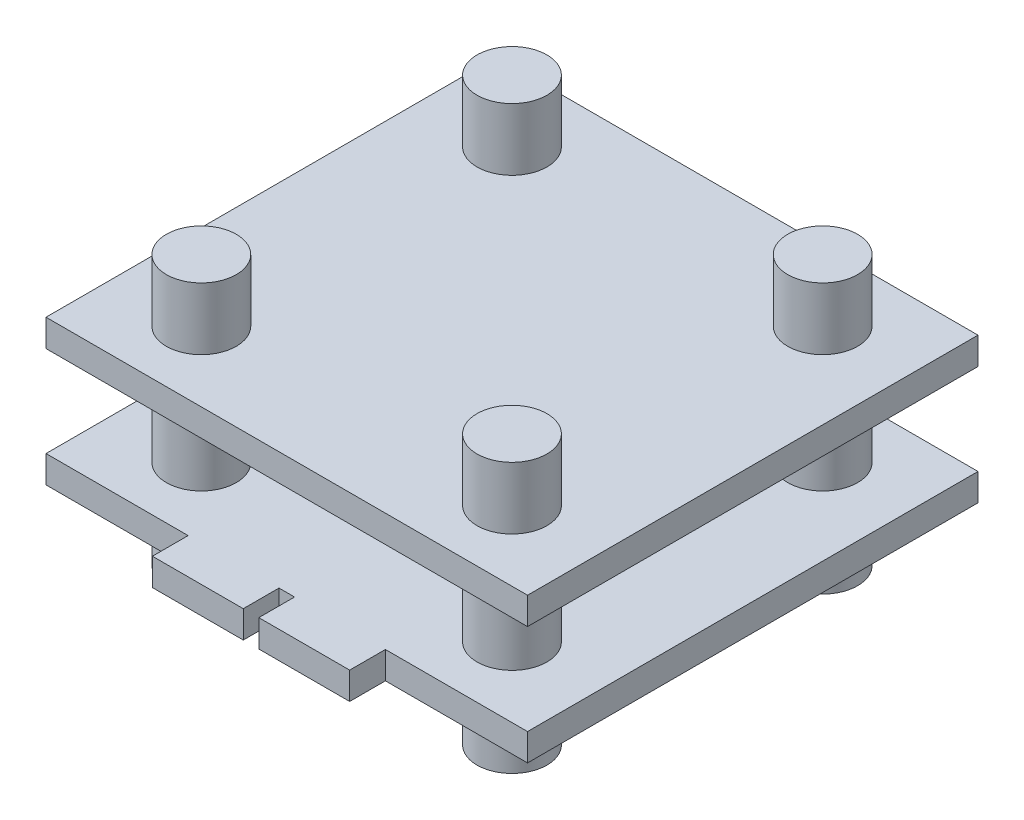
ISO-10303-21;
HEADER;
FILE_DESCRIPTION(('STEP AP214'),'2;1');
FILE_NAME('part.step','',(''),(''),'','','');
FILE_SCHEMA(('AUTOMOTIVE_DESIGN { 1 0 10303 214 1 1 1 1 }'));
ENDSEC;
DATA;
#1=APPLICATION_CONTEXT('core data for automotive mechanical design processes');
#2=APPLICATION_PROTOCOL_DEFINITION('international standard','automotive_design',2000,#1);
#3=PRODUCT_CONTEXT('',#1,'mechanical');
#4=PRODUCT('Part','Part','',(#3));
#5=PRODUCT_RELATED_PRODUCT_CATEGORY('part','',(#4));
#6=PRODUCT_DEFINITION_FORMATION('','',#4);
#7=PRODUCT_DEFINITION_CONTEXT('part definition',#1,'design');
#8=PRODUCT_DEFINITION('design','',#6,#7);
#9=PRODUCT_DEFINITION_SHAPE('','',#8);
#10=(LENGTH_UNIT() NAMED_UNIT(*) SI_UNIT(.MILLI.,.METRE.));
#11=(NAMED_UNIT(*) PLANE_ANGLE_UNIT() SI_UNIT($,.RADIAN.));
#12=(NAMED_UNIT(*) SI_UNIT($,.STERADIAN.) SOLID_ANGLE_UNIT());
#13=UNCERTAINTY_MEASURE_WITH_UNIT(LENGTH_MEASURE(1.E-05),#10,'distance_accuracy_value','');
#14=(GEOMETRIC_REPRESENTATION_CONTEXT(3) GLOBAL_UNCERTAINTY_ASSIGNED_CONTEXT((#13)) GLOBAL_UNIT_ASSIGNED_CONTEXT((#10,
#11,#12)) REPRESENTATION_CONTEXT('',''));
#15=CARTESIAN_POINT('',(0.,0.,0.));
#16=DIRECTION('',(0.,0.,1.));
#17=DIRECTION('',(1.,0.,0.));
#18=AXIS2_PLACEMENT_3D('',#15,#16,#17);
#19=CARTESIAN_POINT('',(-15.5,1.75,14.5));
#20=DIRECTION('',(0.,0.,-1.));
#21=DIRECTION('',(-1.,0.,0.));
#22=AXIS2_PLACEMENT_3D('',#19,#20,#21);
#23=PLANE('',#22);
#24=DIRECTION('',(1.,0.,0.));
#25=VECTOR('',#24,1.);
#26=CARTESIAN_POINT('',(-15.5,1.75,14.5));
#27=LINE('',#26,#25);
#28=CARTESIAN_POINT('',(6.35,1.75,14.5));
#29=VERTEX_POINT('',#28);
#30=CARTESIAN_POINT('',(15.5,1.75,14.5));
#31=VERTEX_POINT('',#30);
#32=EDGE_CURVE('E55',#29,#31,#27,.T.);
#33=ORIENTED_EDGE('',*,*,#32,.F.);
#34=DIRECTION('',(0.,-1.,0.));
#35=VECTOR('',#34,1.);
#36=CARTESIAN_POINT('',(6.35,8.03589691293137,14.5));
#37=LINE('',#36,#35);
#38=CARTESIAN_POINT('',(6.35,0.,14.5));
#39=VERTEX_POINT('',#38);
#40=EDGE_CURVE('E181',#29,#39,#37,.T.);
#41=ORIENTED_EDGE('',*,*,#40,.T.);
#42=DIRECTION('',(1.,0.,0.));
#43=VECTOR('',#42,1.);
#44=CARTESIAN_POINT('',(-15.5,0.,14.5));
#45=LINE('',#44,#43);
#46=CARTESIAN_POINT('',(15.5,0.,14.5));
#47=VERTEX_POINT('',#46);
#48=EDGE_CURVE('E386',#39,#47,#45,.T.);
#49=ORIENTED_EDGE('',*,*,#48,.T.);
#50=DIRECTION('',(0.,-1.,0.));
#51=VECTOR('',#50,1.);
#52=CARTESIAN_POINT('',(15.5,1.75,14.5));
#53=LINE('',#52,#51);
#54=EDGE_CURVE('E375',#31,#47,#53,.T.);
#55=ORIENTED_EDGE('',*,*,#54,.F.);
#56=EDGE_LOOP('',(#33,#41,#49,#55));
#57=FACE_BOUND('',#56,.T.);
#58=ADVANCED_FACE('F39',(#57),#23,.F.);
#59=DIRECTION('',(0.,-1.,0.));
#60=VECTOR('',#59,1.);
#61=CARTESIAN_POINT('',(-6.35,8.03589691293137,14.5));
#62=LINE('',#61,#60);
#63=CARTESIAN_POINT('',(-6.35,1.75,14.5));
#64=VERTEX_POINT('',#63);
#65=CARTESIAN_POINT('',(-6.35,0.,14.5));
#66=VERTEX_POINT('',#65);
#67=EDGE_CURVE('E227',#64,#66,#62,.T.);
#68=ORIENTED_EDGE('',*,*,#67,.F.);
#69=CARTESIAN_POINT('',(-15.5,1.75,14.5));
#70=VERTEX_POINT('',#69);
#71=EDGE_CURVE('E371',#70,#64,#27,.T.);
#72=ORIENTED_EDGE('',*,*,#71,.F.);
#73=DIRECTION('',(0.,-1.,0.));
#74=VECTOR('',#73,1.);
#75=CARTESIAN_POINT('',(-15.5,1.75,14.5));
#76=LINE('',#75,#74);
#77=CARTESIAN_POINT('',(-15.5,0.,14.5));
#78=VERTEX_POINT('',#77);
#79=EDGE_CURVE('E394',#70,#78,#76,.T.);
#80=ORIENTED_EDGE('',*,*,#79,.T.);
#81=EDGE_CURVE('E365',#78,#66,#45,.T.);
#82=ORIENTED_EDGE('',*,*,#81,.T.);
#83=EDGE_LOOP('',(#68,#72,#80,#82));
#84=FACE_BOUND('',#83,.T.);
#85=ADVANCED_FACE('F447',(#84),#23,.F.);
#86=CARTESIAN_POINT('',(15.5,1.75,-14.5));
#87=DIRECTION('',(-1.,0.,0.));
#88=DIRECTION('',(0.,0.,1.));
#89=AXIS2_PLACEMENT_3D('',#86,#87,#88);
#90=PLANE('',#89);
#91=DIRECTION('',(0.,0.,-1.));
#92=VECTOR('',#91,1.);
#93=CARTESIAN_POINT('',(15.5,0.,-14.5));
#94=LINE('',#93,#92);
#95=CARTESIAN_POINT('',(15.5,0.,-14.5));
#96=VERTEX_POINT('',#95);
#97=EDGE_CURVE('E356',#47,#96,#94,.T.);
#98=ORIENTED_EDGE('',*,*,#97,.T.);
#99=DIRECTION('',(0.,-1.,0.));
#100=VECTOR('',#99,1.);
#101=CARTESIAN_POINT('',(15.5,1.75,-14.5));
#102=LINE('',#101,#100);
#103=CARTESIAN_POINT('',(15.5,1.75,-14.5));
#104=VERTEX_POINT('',#103);
#105=EDGE_CURVE('E402',#104,#96,#102,.T.);
#106=ORIENTED_EDGE('',*,*,#105,.F.);
#107=DIRECTION('',(0.,0.,-1.));
#108=VECTOR('',#107,1.);
#109=CARTESIAN_POINT('',(15.5,1.75,-14.5));
#110=LINE('',#109,#108);
#111=EDGE_CURVE('E360',#31,#104,#110,.T.);
#112=ORIENTED_EDGE('',*,*,#111,.F.);
#113=ORIENTED_EDGE('',*,*,#54,.T.);
#114=EDGE_LOOP('',(#98,#106,#112,#113));
#115=FACE_BOUND('',#114,.T.);
#116=ADVANCED_FACE('F41',(#115),#90,.F.);
#117=CARTESIAN_POINT('',(-15.5,1.75,-14.5));
#118=DIRECTION('',(0.,0.,1.));
#119=DIRECTION('',(1.,0.,0.));
#120=AXIS2_PLACEMENT_3D('',#117,#118,#119);
#121=PLANE('',#120);
#122=DIRECTION('',(-1.,0.,0.));
#123=VECTOR('',#122,1.);
#124=CARTESIAN_POINT('',(-15.5,0.,-14.5));
#125=LINE('',#124,#123);
#126=CARTESIAN_POINT('',(-15.5,0.,-14.5));
#127=VERTEX_POINT('',#126);
#128=EDGE_CURVE('E380',#96,#127,#125,.T.);
#129=ORIENTED_EDGE('',*,*,#128,.T.);
#130=DIRECTION('',(0.,-1.,0.));
#131=VECTOR('',#130,1.);
#132=CARTESIAN_POINT('',(-15.5,1.75,-14.5));
#133=LINE('',#132,#131);
#134=CARTESIAN_POINT('',(-15.5,1.75,-14.5));
#135=VERTEX_POINT('',#134);
#136=EDGE_CURVE('E398',#135,#127,#133,.T.);
#137=ORIENTED_EDGE('',*,*,#136,.F.);
#138=DIRECTION('',(-1.,0.,0.));
#139=VECTOR('',#138,1.);
#140=CARTESIAN_POINT('',(-15.5,1.75,-14.5));
#141=LINE('',#140,#139);
#142=EDGE_CURVE('E364',#104,#135,#141,.T.);
#143=ORIENTED_EDGE('',*,*,#142,.F.);
#144=ORIENTED_EDGE('',*,*,#105,.T.);
#145=EDGE_LOOP('',(#129,#137,#143,#144));
#146=FACE_BOUND('',#145,.T.);
#147=ADVANCED_FACE('F463',(#146),#121,.F.);
#148=CARTESIAN_POINT('',(-15.5,1.75,-14.5));
#149=DIRECTION('',(1.,0.,0.));
#150=DIRECTION('',(0.,0.,-1.));
#151=AXIS2_PLACEMENT_3D('',#148,#149,#150);
#152=PLANE('',#151);
#153=DIRECTION('',(0.,0.,1.));
#154=VECTOR('',#153,1.);
#155=CARTESIAN_POINT('',(-15.5,0.,-14.5));
#156=LINE('',#155,#154);
#157=EDGE_CURVE('E383',#127,#78,#156,.T.);
#158=ORIENTED_EDGE('',*,*,#157,.T.);
#159=ORIENTED_EDGE('',*,*,#79,.F.);
#160=DIRECTION('',(0.,0.,1.));
#161=VECTOR('',#160,1.);
#162=CARTESIAN_POINT('',(-15.5,1.75,-14.5));
#163=LINE('',#162,#161);
#164=EDGE_CURVE('E368',#135,#70,#163,.T.);
#165=ORIENTED_EDGE('',*,*,#164,.F.);
#166=ORIENTED_EDGE('',*,*,#136,.T.);
#167=EDGE_LOOP('',(#158,#159,#165,#166));
#168=FACE_BOUND('',#167,.T.);
#169=ADVANCED_FACE('F456',(#168),#152,.F.);
#170=CARTESIAN_POINT('',(-0.500000000000002,0.,14.5));
#171=VERTEX_POINT('',#170);
#172=CARTESIAN_POINT('',(0.5,0.,14.5));
#173=VERTEX_POINT('',#172);
#174=EDGE_CURVE('E390',#171,#173,#45,.T.);
#175=ORIENTED_EDGE('',*,*,#174,.T.);
#176=DIRECTION('',(0.,-1.,0.));
#177=VECTOR('',#176,1.);
#178=CARTESIAN_POINT('',(0.500000000000003,8.03589691293137,14.5));
#179=LINE('',#178,#177);
#180=CARTESIAN_POINT('',(0.5,1.75,14.5));
#181=VERTEX_POINT('',#180);
#182=EDGE_CURVE('E63',#181,#173,#179,.T.);
#183=ORIENTED_EDGE('',*,*,#182,.F.);
#184=CARTESIAN_POINT('',(-0.500000000000002,1.75,14.5));
#185=VERTEX_POINT('',#184);
#186=EDGE_CURVE('E376',#185,#181,#27,.T.);
#187=ORIENTED_EDGE('',*,*,#186,.F.);
#188=DIRECTION('',(0.,-1.,0.));
#189=VECTOR('',#188,1.);
#190=CARTESIAN_POINT('',(-0.500000000000002,8.03589691293137,14.5));
#191=LINE('',#190,#189);
#192=EDGE_CURVE('E223',#185,#171,#191,.T.);
#193=ORIENTED_EDGE('',*,*,#192,.T.);
#194=EDGE_LOOP('',(#175,#183,#187,#193));
#195=FACE_BOUND('',#194,.T.);
#196=ADVANCED_FACE('F449',(#195),#23,.F.);
#197=CARTESIAN_POINT('',(0.,1.75,0.));
#198=DIRECTION('',(0.,1.,0.));
#199=DIRECTION('',(0.,0.,1.));
#200=AXIS2_PLACEMENT_3D('',#197,#198,#199);
#201=PLANE('',#200);
#202=CARTESIAN_POINT('',(-10.,1.75,9.99999999999999));
#203=DIRECTION('',(0.,1.,0.));
#204=DIRECTION('',(0.,0.,-1.));
#205=AXIS2_PLACEMENT_3D('',#202,#203,#204);
#206=CIRCLE('',#205,2.25);
#207=CARTESIAN_POINT('',(-10.,1.75,7.74999999999999));
#208=VERTEX_POINT('',#207);
#209=EDGE_CURVE('E327',#208,#208,#206,.T.);
#210=ORIENTED_EDGE('',*,*,#209,.F.);
#211=EDGE_LOOP('',(#210));
#212=FACE_BOUND('',#211,.T.);
#213=CARTESIAN_POINT('',(9.99999999999999,1.75,10.));
#214=DIRECTION('',(0.,1.,0.));
#215=DIRECTION('',(0.,0.,1.));
#216=AXIS2_PLACEMENT_3D('',#213,#214,#215);
#217=CIRCLE('',#216,2.25);
#218=CARTESIAN_POINT('',(9.99999999999999,1.75,12.25));
#219=VERTEX_POINT('',#218);
#220=EDGE_CURVE('E332',#219,#219,#217,.T.);
#221=ORIENTED_EDGE('',*,*,#220,.F.);
#222=EDGE_LOOP('',(#221));
#223=FACE_BOUND('',#222,.T.);
#224=CARTESIAN_POINT('',(10.,1.75,-10.));
#225=DIRECTION('',(0.,1.,0.));
#226=DIRECTION('',(0.,0.,-1.));
#227=AXIS2_PLACEMENT_3D('',#224,#225,#226);
#228=CIRCLE('',#227,2.25);
#229=CARTESIAN_POINT('',(10.,1.75,-12.25));
#230=VERTEX_POINT('',#229);
#231=EDGE_CURVE('E340',#230,#230,#228,.T.);
#232=ORIENTED_EDGE('',*,*,#231,.F.);
#233=EDGE_LOOP('',(#232));
#234=FACE_BOUND('',#233,.T.);
#235=CARTESIAN_POINT('',(-10.,1.75,-10.));
#236=DIRECTION('',(0.,1.,0.));
#237=DIRECTION('',(0.,0.,1.));
#238=AXIS2_PLACEMENT_3D('',#235,#236,#237);
#239=CIRCLE('',#238,2.25);
#240=CARTESIAN_POINT('',(-10.,1.75,-7.75));
#241=VERTEX_POINT('',#240);
#242=EDGE_CURVE('E348',#241,#241,#239,.T.);
#243=ORIENTED_EDGE('',*,*,#242,.F.);
#244=EDGE_LOOP('',(#243));
#245=FACE_BOUND('',#244,.T.);
#246=ORIENTED_EDGE('',*,*,#111,.T.);
#247=ORIENTED_EDGE('',*,*,#142,.T.);
#248=ORIENTED_EDGE('',*,*,#164,.T.);
#249=ORIENTED_EDGE('',*,*,#71,.T.);
#250=DIRECTION('',(0.,0.,-1.));
#251=VECTOR('',#250,1.);
#252=CARTESIAN_POINT('',(-6.35,1.75,14.5));
#253=LINE('',#252,#251);
#254=CARTESIAN_POINT('',(-6.35,1.75,16.8));
#255=VERTEX_POINT('',#254);
#256=EDGE_CURVE('E224',#255,#64,#253,.T.);
#257=ORIENTED_EDGE('',*,*,#256,.F.);
#258=DIRECTION('',(-1.,0.,0.));
#259=VECTOR('',#258,1.);
#260=CARTESIAN_POINT('',(-0.5,1.75,16.8));
#261=LINE('',#260,#259);
#262=CARTESIAN_POINT('',(-0.5,1.75,16.8));
#263=VERTEX_POINT('',#262);
#264=EDGE_CURVE('E206',#263,#255,#261,.T.);
#265=ORIENTED_EDGE('',*,*,#264,.F.);
#266=DIRECTION('',(0.,0.,1.));
#267=VECTOR('',#266,1.);
#268=CARTESIAN_POINT('',(-0.500000000000002,1.75,14.5));
#269=LINE('',#268,#267);
#270=EDGE_CURVE('E218',#185,#263,#269,.T.);
#271=ORIENTED_EDGE('',*,*,#270,.F.);
#272=ORIENTED_EDGE('',*,*,#186,.T.);
#273=DIRECTION('',(0.,0.,-1.));
#274=VECTOR('',#273,1.);
#275=CARTESIAN_POINT('',(0.500000000000003,1.75,14.5));
#276=LINE('',#275,#274);
#277=CARTESIAN_POINT('',(0.499999999999999,1.75,16.8));
#278=VERTEX_POINT('',#277);
#279=EDGE_CURVE('E166',#278,#181,#276,.T.);
#280=ORIENTED_EDGE('',*,*,#279,.F.);
#281=DIRECTION('',(-1.,0.,0.));
#282=VECTOR('',#281,1.);
#283=CARTESIAN_POINT('',(0.499999999999999,1.75,16.8));
#284=LINE('',#283,#282);
#285=CARTESIAN_POINT('',(6.35,1.75,16.8));
#286=VERTEX_POINT('',#285);
#287=EDGE_CURVE('E162',#286,#278,#284,.T.);
#288=ORIENTED_EDGE('',*,*,#287,.F.);
#289=DIRECTION('',(0.,0.,1.));
#290=VECTOR('',#289,1.);
#291=CARTESIAN_POINT('',(6.35,1.75,14.5));
#292=LINE('',#291,#290);
#293=EDGE_CURVE('E185',#29,#286,#292,.T.);
#294=ORIENTED_EDGE('',*,*,#293,.F.);
#295=ORIENTED_EDGE('',*,*,#32,.T.);
#296=EDGE_LOOP('',(#246,#247,#248,#249,#257,#265,#271,#272,#280,#288,#294,#295));
#297=FACE_BOUND('',#296,.T.);
#298=ADVANCED_FACE('F422',(#212,#223,#234,#245,#297),#201,.T.);
#299=CARTESIAN_POINT('',(0.,0.,0.));
#300=DIRECTION('',(0.,1.,0.));
#301=DIRECTION('',(0.,0.,1.));
#302=AXIS2_PLACEMENT_3D('',#299,#300,#301);
#303=PLANE('',#302);
#304=CARTESIAN_POINT('',(-10.,0.,9.99999999999999));
#305=DIRECTION('',(0.,1.,0.));
#306=DIRECTION('',(0.,0.,1.));
#307=AXIS2_PLACEMENT_3D('',#304,#305,#306);
#308=CIRCLE('',#307,2.25);
#309=CARTESIAN_POINT('',(-10.,0.,12.25));
#310=VERTEX_POINT('',#309);
#311=EDGE_CURVE('E11',#310,#310,#308,.F.);
#312=ORIENTED_EDGE('',*,*,#311,.F.);
#313=EDGE_LOOP('',(#312));
#314=FACE_BOUND('',#313,.T.);
#315=CARTESIAN_POINT('',(-10.,0.,-10.));
#316=DIRECTION('',(0.,1.,0.));
#317=DIRECTION('',(0.,0.,1.));
#318=AXIS2_PLACEMENT_3D('',#315,#316,#317);
#319=CIRCLE('',#318,2.25);
#320=CARTESIAN_POINT('',(-10.,0.,-7.75));
#321=VERTEX_POINT('',#320);
#322=EDGE_CURVE('E48',#321,#321,#319,.F.);
#323=ORIENTED_EDGE('',*,*,#322,.F.);
#324=EDGE_LOOP('',(#323));
#325=FACE_BOUND('',#324,.T.);
#326=CARTESIAN_POINT('',(10.,0.,-10.));
#327=DIRECTION('',(0.,1.,0.));
#328=DIRECTION('',(0.,0.,1.));
#329=AXIS2_PLACEMENT_3D('',#326,#327,#328);
#330=CIRCLE('',#329,2.25);
#331=CARTESIAN_POINT('',(10.,0.,-7.75000000000001));
#332=VERTEX_POINT('',#331);
#333=EDGE_CURVE('E410',#332,#332,#330,.F.);
#334=ORIENTED_EDGE('',*,*,#333,.F.);
#335=EDGE_LOOP('',(#334));
#336=FACE_BOUND('',#335,.T.);
#337=CARTESIAN_POINT('',(9.99999999999999,0.,10.));
#338=DIRECTION('',(0.,1.,0.));
#339=DIRECTION('',(0.,0.,1.));
#340=AXIS2_PLACEMENT_3D('',#337,#338,#339);
#341=CIRCLE('',#340,2.25);
#342=CARTESIAN_POINT('',(9.99999999999999,0.,12.25));
#343=VERTEX_POINT('',#342);
#344=EDGE_CURVE('E406',#343,#343,#341,.F.);
#345=ORIENTED_EDGE('',*,*,#344,.F.);
#346=EDGE_LOOP('',(#345));
#347=FACE_BOUND('',#346,.T.);
#348=ORIENTED_EDGE('',*,*,#97,.F.);
#349=ORIENTED_EDGE('',*,*,#48,.F.);
#350=DIRECTION('',(0.,0.,1.));
#351=VECTOR('',#350,1.);
#352=CARTESIAN_POINT('',(6.35,0.,14.5));
#353=LINE('',#352,#351);
#354=CARTESIAN_POINT('',(6.35,0.,16.8));
#355=VERTEX_POINT('',#354);
#356=EDGE_CURVE('E174',#39,#355,#353,.T.);
#357=ORIENTED_EDGE('',*,*,#356,.T.);
#358=DIRECTION('',(-1.,0.,0.));
#359=VECTOR('',#358,1.);
#360=CARTESIAN_POINT('',(0.499999999999999,0.,16.8));
#361=LINE('',#360,#359);
#362=CARTESIAN_POINT('',(0.499999999999999,0.,16.8));
#363=VERTEX_POINT('',#362);
#364=EDGE_CURVE('E161',#355,#363,#361,.T.);
#365=ORIENTED_EDGE('',*,*,#364,.T.);
#366=DIRECTION('',(0.,0.,-1.));
#367=VECTOR('',#366,1.);
#368=CARTESIAN_POINT('',(0.500000000000003,0.,14.5));
#369=LINE('',#368,#367);
#370=EDGE_CURVE('E169',#363,#173,#369,.T.);
#371=ORIENTED_EDGE('',*,*,#370,.T.);
#372=ORIENTED_EDGE('',*,*,#174,.F.);
#373=DIRECTION('',(0.,0.,1.));
#374=VECTOR('',#373,1.);
#375=CARTESIAN_POINT('',(-0.500000000000002,0.,14.5));
#376=LINE('',#375,#374);
#377=CARTESIAN_POINT('',(-0.5,0.,16.8));
#378=VERTEX_POINT('',#377);
#379=EDGE_CURVE('E201',#171,#378,#376,.T.);
#380=ORIENTED_EDGE('',*,*,#379,.T.);
#381=DIRECTION('',(-1.,0.,0.));
#382=VECTOR('',#381,1.);
#383=CARTESIAN_POINT('',(-0.5,0.,16.8));
#384=LINE('',#383,#382);
#385=CARTESIAN_POINT('',(-6.35,0.,16.8));
#386=VERTEX_POINT('',#385);
#387=EDGE_CURVE('E207',#378,#386,#384,.T.);
#388=ORIENTED_EDGE('',*,*,#387,.T.);
#389=DIRECTION('',(0.,0.,-1.));
#390=VECTOR('',#389,1.);
#391=CARTESIAN_POINT('',(-6.35,0.,14.5));
#392=LINE('',#391,#390);
#393=EDGE_CURVE('E202',#386,#66,#392,.T.);
#394=ORIENTED_EDGE('',*,*,#393,.T.);
#395=ORIENTED_EDGE('',*,*,#81,.F.);
#396=ORIENTED_EDGE('',*,*,#157,.F.);
#397=ORIENTED_EDGE('',*,*,#128,.F.);
#398=EDGE_LOOP('',(#348,#349,#357,#365,#371,#372,#380,#388,#394,#395,#396,#397));
#399=FACE_BOUND('',#398,.T.);
#400=ADVANCED_FACE('F178',(#314,#325,#336,#347,#399),#303,.F.);
#401=CARTESIAN_POINT('',(-10.,7.6,-10.));
#402=DIRECTION('',(0.,-1.,0.));
#403=DIRECTION('',(0.,0.,-1.));
#404=AXIS2_PLACEMENT_3D('',#401,#402,#403);
#405=CYLINDRICAL_SURFACE('',#404,2.25);
#406=CARTESIAN_POINT('',(-10.,7.6,-10.));
#407=DIRECTION('',(0.,1.,0.));
#408=DIRECTION('',(0.,0.,1.));
#409=AXIS2_PLACEMENT_3D('',#406,#407,#408);
#410=CIRCLE('',#409,2.25);
#411=CARTESIAN_POINT('',(-10.,7.6,-7.75));
#412=VERTEX_POINT('',#411);
#413=EDGE_CURVE('E352',#412,#412,#410,.T.);
#414=ORIENTED_EDGE('',*,*,#413,.F.);
#415=EDGE_LOOP('',(#414));
#416=FACE_BOUND('',#415,.T.);
#417=ORIENTED_EDGE('',*,*,#242,.T.);
#418=EDGE_LOOP('',(#417));
#419=FACE_BOUND('',#418,.T.);
#420=ADVANCED_FACE('F421',(#416,#419),#405,.T.);
#421=CARTESIAN_POINT('',(10.,7.6,-10.));
#422=DIRECTION('',(0.,-1.,0.));
#423=DIRECTION('',(0.,0.,-1.));
#424=AXIS2_PLACEMENT_3D('',#421,#422,#423);
#425=CYLINDRICAL_SURFACE('',#424,2.25);
#426=CARTESIAN_POINT('',(10.,7.6,-10.));
#427=DIRECTION('',(0.,1.,0.));
#428=DIRECTION('',(0.,0.,-1.));
#429=AXIS2_PLACEMENT_3D('',#426,#427,#428);
#430=CIRCLE('',#429,2.25);
#431=CARTESIAN_POINT('',(10.,7.6,-12.25));
#432=VERTEX_POINT('',#431);
#433=EDGE_CURVE('E344',#432,#432,#430,.T.);
#434=ORIENTED_EDGE('',*,*,#433,.F.);
#435=EDGE_LOOP('',(#434));
#436=FACE_BOUND('',#435,.T.);
#437=ORIENTED_EDGE('',*,*,#231,.T.);
#438=EDGE_LOOP('',(#437));
#439=FACE_BOUND('',#438,.T.);
#440=ADVANCED_FACE('F639',(#436,#439),#425,.T.);
#441=CARTESIAN_POINT('',(9.99999999999999,7.6,10.));
#442=DIRECTION('',(0.,-1.,0.));
#443=DIRECTION('',(0.,0.,-1.));
#444=AXIS2_PLACEMENT_3D('',#441,#442,#443);
#445=CYLINDRICAL_SURFACE('',#444,2.25);
#446=CARTESIAN_POINT('',(9.99999999999999,7.6,10.));
#447=DIRECTION('',(0.,1.,0.));
#448=DIRECTION('',(0.,0.,1.));
#449=AXIS2_PLACEMENT_3D('',#446,#447,#448);
#450=CIRCLE('',#449,2.25);
#451=CARTESIAN_POINT('',(9.99999999999999,7.6,12.25));
#452=VERTEX_POINT('',#451);
#453=EDGE_CURVE('E336',#452,#452,#450,.T.);
#454=ORIENTED_EDGE('',*,*,#453,.F.);
#455=EDGE_LOOP('',(#454));
#456=FACE_BOUND('',#455,.T.);
#457=ORIENTED_EDGE('',*,*,#220,.T.);
#458=EDGE_LOOP('',(#457));
#459=FACE_BOUND('',#458,.T.);
#460=ADVANCED_FACE('F649',(#456,#459),#445,.T.);
#461=CARTESIAN_POINT('',(-10.,7.6,9.99999999999999));
#462=DIRECTION('',(0.,-1.,0.));
#463=DIRECTION('',(0.,0.,-1.));
#464=AXIS2_PLACEMENT_3D('',#461,#462,#463);
#465=CYLINDRICAL_SURFACE('',#464,2.25);
#466=CARTESIAN_POINT('',(-10.,7.6,9.99999999999999));
#467=DIRECTION('',(0.,1.,0.));
#468=DIRECTION('',(0.,0.,-1.));
#469=AXIS2_PLACEMENT_3D('',#466,#467,#468);
#470=CIRCLE('',#469,2.25);
#471=CARTESIAN_POINT('',(-10.,7.6,7.74999999999999));
#472=VERTEX_POINT('',#471);
#473=EDGE_CURVE('E328',#472,#472,#470,.T.);
#474=ORIENTED_EDGE('',*,*,#473,.F.);
#475=EDGE_LOOP('',(#474));
#476=FACE_BOUND('',#475,.T.);
#477=ORIENTED_EDGE('',*,*,#209,.T.);
#478=EDGE_LOOP('',(#477));
#479=FACE_BOUND('',#478,.T.);
#480=ADVANCED_FACE('F658',(#476,#479),#465,.T.);
#481=CARTESIAN_POINT('',(-15.5,9.35,14.5));
#482=DIRECTION('',(0.,0.,-1.));
#483=DIRECTION('',(-1.,0.,0.));
#484=AXIS2_PLACEMENT_3D('',#481,#482,#483);
#485=PLANE('',#484);
#486=DIRECTION('',(1.,0.,0.));
#487=VECTOR('',#486,1.);
#488=CARTESIAN_POINT('',(-15.5,7.6,14.5));
#489=LINE('',#488,#487);
#490=CARTESIAN_POINT('',(-15.5,7.6,14.5));
#491=VERTEX_POINT('',#490);
#492=CARTESIAN_POINT('',(15.5,7.6,14.5));
#493=VERTEX_POINT('',#492);
#494=EDGE_CURVE('E282',#491,#493,#489,.T.);
#495=ORIENTED_EDGE('',*,*,#494,.T.);
#496=DIRECTION('',(0.,-1.,0.));
#497=VECTOR('',#496,1.);
#498=CARTESIAN_POINT('',(15.5,9.35,14.5));
#499=LINE('',#498,#497);
#500=CARTESIAN_POINT('',(15.5,9.35,14.5));
#501=VERTEX_POINT('',#500);
#502=EDGE_CURVE('E323',#501,#493,#499,.T.);
#503=ORIENTED_EDGE('',*,*,#502,.F.);
#504=DIRECTION('',(1.,0.,0.));
#505=VECTOR('',#504,1.);
#506=CARTESIAN_POINT('',(-15.5,9.35,14.5));
#507=LINE('',#506,#505);
#508=CARTESIAN_POINT('',(-15.5,9.35,14.5));
#509=VERTEX_POINT('',#508);
#510=EDGE_CURVE('E286',#509,#501,#507,.T.);
#511=ORIENTED_EDGE('',*,*,#510,.F.);
#512=DIRECTION('',(0.,-1.,0.));
#513=VECTOR('',#512,1.);
#514=CARTESIAN_POINT('',(-15.5,9.35,14.5));
#515=LINE('',#514,#513);
#516=EDGE_CURVE('E300',#509,#491,#515,.T.);
#517=ORIENTED_EDGE('',*,*,#516,.T.);
#518=EDGE_LOOP('',(#495,#503,#511,#517));
#519=FACE_BOUND('',#518,.T.);
#520=ADVANCED_FACE('F667',(#519),#485,.F.);
#521=CARTESIAN_POINT('',(15.5,9.35,14.5));
#522=DIRECTION('',(-1.,0.,0.));
#523=DIRECTION('',(0.,0.,1.));
#524=AXIS2_PLACEMENT_3D('',#521,#522,#523);
#525=PLANE('',#524);
#526=DIRECTION('',(0.,0.,-1.));
#527=VECTOR('',#526,1.);
#528=CARTESIAN_POINT('',(15.5,7.6,14.5));
#529=LINE('',#528,#527);
#530=CARTESIAN_POINT('',(15.5,7.6,-14.5));
#531=VERTEX_POINT('',#530);
#532=EDGE_CURVE('E304',#493,#531,#529,.T.);
#533=ORIENTED_EDGE('',*,*,#532,.T.);
#534=DIRECTION('',(0.,-1.,0.));
#535=VECTOR('',#534,1.);
#536=CARTESIAN_POINT('',(15.5,9.35,-14.5));
#537=LINE('',#536,#535);
#538=CARTESIAN_POINT('',(15.5,9.35,-14.5));
#539=VERTEX_POINT('',#538);
#540=EDGE_CURVE('E319',#539,#531,#537,.T.);
#541=ORIENTED_EDGE('',*,*,#540,.F.);
#542=DIRECTION('',(0.,0.,-1.));
#543=VECTOR('',#542,1.);
#544=CARTESIAN_POINT('',(15.5,9.35,14.5));
#545=LINE('',#544,#543);
#546=EDGE_CURVE('E290',#501,#539,#545,.T.);
#547=ORIENTED_EDGE('',*,*,#546,.F.);
#548=ORIENTED_EDGE('',*,*,#502,.T.);
#549=EDGE_LOOP('',(#533,#541,#547,#548));
#550=FACE_BOUND('',#549,.T.);
#551=ADVANCED_FACE('F676',(#550),#525,.F.);
#552=CARTESIAN_POINT('',(15.5,9.35,-14.5));
#553=DIRECTION('',(0.,0.,1.));
#554=DIRECTION('',(1.,0.,0.));
#555=AXIS2_PLACEMENT_3D('',#552,#553,#554);
#556=PLANE('',#555);
#557=DIRECTION('',(-1.,0.,0.));
#558=VECTOR('',#557,1.);
#559=CARTESIAN_POINT('',(15.5,7.6,-14.5));
#560=LINE('',#559,#558);
#561=CARTESIAN_POINT('',(-15.5,7.6,-14.5));
#562=VERTEX_POINT('',#561);
#563=EDGE_CURVE('E307',#531,#562,#560,.T.);
#564=ORIENTED_EDGE('',*,*,#563,.T.);
#565=DIRECTION('',(0.,-1.,0.));
#566=VECTOR('',#565,1.);
#567=CARTESIAN_POINT('',(-15.5,9.35,-14.5));
#568=LINE('',#567,#566);
#569=CARTESIAN_POINT('',(-15.5,9.35,-14.5));
#570=VERTEX_POINT('',#569);
#571=EDGE_CURVE('E315',#570,#562,#568,.T.);
#572=ORIENTED_EDGE('',*,*,#571,.F.);
#573=DIRECTION('',(-1.,0.,0.));
#574=VECTOR('',#573,1.);
#575=CARTESIAN_POINT('',(15.5,9.35,-14.5));
#576=LINE('',#575,#574);
#577=EDGE_CURVE('E294',#539,#570,#576,.T.);
#578=ORIENTED_EDGE('',*,*,#577,.F.);
#579=ORIENTED_EDGE('',*,*,#540,.T.);
#580=EDGE_LOOP('',(#564,#572,#578,#579));
#581=FACE_BOUND('',#580,.T.);
#582=ADVANCED_FACE('F685',(#581),#556,.F.);
#583=CARTESIAN_POINT('',(-15.5,9.35,-14.5));
#584=DIRECTION('',(1.,0.,0.));
#585=DIRECTION('',(0.,0.,-1.));
#586=AXIS2_PLACEMENT_3D('',#583,#584,#585);
#587=PLANE('',#586);
#588=DIRECTION('',(0.,0.,1.));
#589=VECTOR('',#588,1.);
#590=CARTESIAN_POINT('',(-15.5,7.6,-14.5));
#591=LINE('',#590,#589);
#592=EDGE_CURVE('E291',#562,#491,#591,.T.);
#593=ORIENTED_EDGE('',*,*,#592,.T.);
#594=ORIENTED_EDGE('',*,*,#516,.F.);
#595=DIRECTION('',(0.,0.,1.));
#596=VECTOR('',#595,1.);
#597=CARTESIAN_POINT('',(-15.5,9.35,-14.5));
#598=LINE('',#597,#596);
#599=EDGE_CURVE('E297',#570,#509,#598,.T.);
#600=ORIENTED_EDGE('',*,*,#599,.F.);
#601=ORIENTED_EDGE('',*,*,#571,.T.);
#602=EDGE_LOOP('',(#593,#594,#600,#601));
#603=FACE_BOUND('',#602,.T.);
#604=ADVANCED_FACE('F694',(#603),#587,.F.);
#605=CARTESIAN_POINT('',(0.,9.35,0.));
#606=DIRECTION('',(0.,1.,0.));
#607=DIRECTION('',(0.,0.,1.));
#608=AXIS2_PLACEMENT_3D('',#605,#606,#607);
#609=PLANE('',#608);
#610=CARTESIAN_POINT('',(-10.,9.35,9.99999999999999));
#611=DIRECTION('',(0.,1.,0.));
#612=DIRECTION('',(0.,0.,1.));
#613=AXIS2_PLACEMENT_3D('',#610,#611,#612);
#614=CIRCLE('',#613,2.25);
#615=CARTESIAN_POINT('',(-10.,9.35,12.25));
#616=VERTEX_POINT('',#615);
#617=EDGE_CURVE('E253',#616,#616,#614,.T.);
#618=ORIENTED_EDGE('',*,*,#617,.F.);
#619=EDGE_LOOP('',(#618));
#620=FACE_BOUND('',#619,.T.);
#621=CARTESIAN_POINT('',(9.99999999999999,9.35,10.));
#622=DIRECTION('',(0.,1.,0.));
#623=DIRECTION('',(0.,0.,1.));
#624=AXIS2_PLACEMENT_3D('',#621,#622,#623);
#625=CIRCLE('',#624,2.25);
#626=CARTESIAN_POINT('',(9.99999999999999,9.35,12.25));
#627=VERTEX_POINT('',#626);
#628=EDGE_CURVE('E258',#627,#627,#625,.T.);
#629=ORIENTED_EDGE('',*,*,#628,.F.);
#630=EDGE_LOOP('',(#629));
#631=FACE_BOUND('',#630,.T.);
#632=CARTESIAN_POINT('',(10.,9.35,-10.));
#633=DIRECTION('',(0.,1.,0.));
#634=DIRECTION('',(0.,0.,1.));
#635=AXIS2_PLACEMENT_3D('',#632,#633,#634);
#636=CIRCLE('',#635,2.25);
#637=CARTESIAN_POINT('',(10.,9.35,-7.75000000000001));
#638=VERTEX_POINT('',#637);
#639=EDGE_CURVE('E266',#638,#638,#636,.T.);
#640=ORIENTED_EDGE('',*,*,#639,.F.);
#641=EDGE_LOOP('',(#640));
#642=FACE_BOUND('',#641,.T.);
#643=CARTESIAN_POINT('',(-10.,9.35,-10.));
#644=DIRECTION('',(0.,1.,0.));
#645=DIRECTION('',(0.,0.,1.));
#646=AXIS2_PLACEMENT_3D('',#643,#644,#645);
#647=CIRCLE('',#646,2.25);
#648=CARTESIAN_POINT('',(-10.,9.35,-7.75));
#649=VERTEX_POINT('',#648);
#650=EDGE_CURVE('E274',#649,#649,#647,.T.);
#651=ORIENTED_EDGE('',*,*,#650,.F.);
#652=EDGE_LOOP('',(#651));
#653=FACE_BOUND('',#652,.T.);
#654=ORIENTED_EDGE('',*,*,#510,.T.);
#655=ORIENTED_EDGE('',*,*,#546,.T.);
#656=ORIENTED_EDGE('',*,*,#577,.T.);
#657=ORIENTED_EDGE('',*,*,#599,.T.);
#658=EDGE_LOOP('',(#654,#655,#656,#657));
#659=FACE_BOUND('',#658,.T.);
#660=ADVANCED_FACE('F703',(#620,#631,#642,#653,#659),#609,.T.);
#661=CARTESIAN_POINT('',(0.,7.6,0.));
#662=DIRECTION('',(0.,1.,0.));
#663=DIRECTION('',(0.,0.,1.));
#664=AXIS2_PLACEMENT_3D('',#661,#662,#663);
#665=PLANE('',#664);
#666=ORIENTED_EDGE('',*,*,#413,.T.);
#667=EDGE_LOOP('',(#666));
#668=FACE_BOUND('',#667,.T.);
#669=ORIENTED_EDGE('',*,*,#433,.T.);
#670=EDGE_LOOP('',(#669));
#671=FACE_BOUND('',#670,.T.);
#672=ORIENTED_EDGE('',*,*,#453,.T.);
#673=EDGE_LOOP('',(#672));
#674=FACE_BOUND('',#673,.T.);
#675=ORIENTED_EDGE('',*,*,#473,.T.);
#676=EDGE_LOOP('',(#675));
#677=FACE_BOUND('',#676,.T.);
#678=ORIENTED_EDGE('',*,*,#494,.F.);
#679=ORIENTED_EDGE('',*,*,#592,.F.);
#680=ORIENTED_EDGE('',*,*,#563,.F.);
#681=ORIENTED_EDGE('',*,*,#532,.F.);
#682=EDGE_LOOP('',(#678,#679,#680,#681));
#683=FACE_BOUND('',#682,.T.);
#684=ADVANCED_FACE('F713',(#668,#671,#674,#677,#683),#665,.F.);
#685=CARTESIAN_POINT('',(-10.,13.35,-10.));
#686=DIRECTION('',(0.,-1.,0.));
#687=DIRECTION('',(0.,0.,-1.));
#688=AXIS2_PLACEMENT_3D('',#685,#686,#687);
#689=CYLINDRICAL_SURFACE('',#688,2.25);
#690=CARTESIAN_POINT('',(-10.,13.35,-10.));
#691=DIRECTION('',(0.,1.,0.));
#692=DIRECTION('',(0.,0.,1.));
#693=AXIS2_PLACEMENT_3D('',#690,#691,#692);
#694=CIRCLE('',#693,2.25);
#695=CARTESIAN_POINT('',(-10.,13.35,-7.75));
#696=VERTEX_POINT('',#695);
#697=EDGE_CURVE('E278',#696,#696,#694,.T.);
#698=ORIENTED_EDGE('',*,*,#697,.F.);
#699=EDGE_LOOP('',(#698));
#700=FACE_BOUND('',#699,.T.);
#701=ORIENTED_EDGE('',*,*,#650,.T.);
#702=EDGE_LOOP('',(#701));
#703=FACE_BOUND('',#702,.T.);
#704=ADVANCED_FACE('F722',(#700,#703),#689,.T.);
#705=CARTESIAN_POINT('',(-10.,13.35,-10.));
#706=DIRECTION('',(0.,1.,0.));
#707=DIRECTION('',(0.,0.,1.));
#708=AXIS2_PLACEMENT_3D('',#705,#706,#707);
#709=PLANE('',#708);
#710=ORIENTED_EDGE('',*,*,#697,.T.);
#711=EDGE_LOOP('',(#710));
#712=FACE_BOUND('',#711,.T.);
#713=ADVANCED_FACE('F730',(#712),#709,.T.);
#714=CARTESIAN_POINT('',(10.,13.35,-10.));
#715=DIRECTION('',(0.,-1.,0.));
#716=DIRECTION('',(0.,0.,-1.));
#717=AXIS2_PLACEMENT_3D('',#714,#715,#716);
#718=CYLINDRICAL_SURFACE('',#717,2.25);
#719=CARTESIAN_POINT('',(10.,13.35,-10.));
#720=DIRECTION('',(0.,1.,0.));
#721=DIRECTION('',(0.,0.,1.));
#722=AXIS2_PLACEMENT_3D('',#719,#720,#721);
#723=CIRCLE('',#722,2.25);
#724=CARTESIAN_POINT('',(10.,13.35,-7.75000000000001));
#725=VERTEX_POINT('',#724);
#726=EDGE_CURVE('E270',#725,#725,#723,.T.);
#727=ORIENTED_EDGE('',*,*,#726,.F.);
#728=EDGE_LOOP('',(#727));
#729=FACE_BOUND('',#728,.T.);
#730=ORIENTED_EDGE('',*,*,#639,.T.);
#731=EDGE_LOOP('',(#730));
#732=FACE_BOUND('',#731,.T.);
#733=ADVANCED_FACE('F739',(#729,#732),#718,.T.);
#734=CARTESIAN_POINT('',(10.,13.35,-10.));
#735=DIRECTION('',(0.,1.,0.));
#736=DIRECTION('',(0.,0.,1.));
#737=AXIS2_PLACEMENT_3D('',#734,#735,#736);
#738=PLANE('',#737);
#739=ORIENTED_EDGE('',*,*,#726,.T.);
#740=EDGE_LOOP('',(#739));
#741=FACE_BOUND('',#740,.T.);
#742=ADVANCED_FACE('F748',(#741),#738,.T.);
#743=CARTESIAN_POINT('',(9.99999999999999,13.35,10.));
#744=DIRECTION('',(0.,-1.,0.));
#745=DIRECTION('',(0.,0.,-1.));
#746=AXIS2_PLACEMENT_3D('',#743,#744,#745);
#747=CYLINDRICAL_SURFACE('',#746,2.25);
#748=CARTESIAN_POINT('',(9.99999999999999,13.35,10.));
#749=DIRECTION('',(0.,1.,0.));
#750=DIRECTION('',(0.,0.,1.));
#751=AXIS2_PLACEMENT_3D('',#748,#749,#750);
#752=CIRCLE('',#751,2.25);
#753=CARTESIAN_POINT('',(9.99999999999999,13.35,12.25));
#754=VERTEX_POINT('',#753);
#755=EDGE_CURVE('E262',#754,#754,#752,.T.);
#756=ORIENTED_EDGE('',*,*,#755,.F.);
#757=EDGE_LOOP('',(#756));
#758=FACE_BOUND('',#757,.T.);
#759=ORIENTED_EDGE('',*,*,#628,.T.);
#760=EDGE_LOOP('',(#759));
#761=FACE_BOUND('',#760,.T.);
#762=ADVANCED_FACE('F757',(#758,#761),#747,.T.);
#763=CARTESIAN_POINT('',(9.99999999999999,13.35,10.));
#764=DIRECTION('',(0.,1.,0.));
#765=DIRECTION('',(0.,0.,1.));
#766=AXIS2_PLACEMENT_3D('',#763,#764,#765);
#767=PLANE('',#766);
#768=ORIENTED_EDGE('',*,*,#755,.T.);
#769=EDGE_LOOP('',(#768));
#770=FACE_BOUND('',#769,.T.);
#771=ADVANCED_FACE('F766',(#770),#767,.T.);
#772=CARTESIAN_POINT('',(-10.,13.35,9.99999999999999));
#773=DIRECTION('',(0.,-1.,0.));
#774=DIRECTION('',(0.,0.,-1.));
#775=AXIS2_PLACEMENT_3D('',#772,#773,#774);
#776=CYLINDRICAL_SURFACE('',#775,2.25);
#777=CARTESIAN_POINT('',(-10.,13.35,9.99999999999999));
#778=DIRECTION('',(0.,1.,0.));
#779=DIRECTION('',(0.,0.,1.));
#780=AXIS2_PLACEMENT_3D('',#777,#778,#779);
#781=CIRCLE('',#780,2.25);
#782=CARTESIAN_POINT('',(-10.,13.35,12.25));
#783=VERTEX_POINT('',#782);
#784=EDGE_CURVE('E254',#783,#783,#781,.T.);
#785=ORIENTED_EDGE('',*,*,#784,.F.);
#786=EDGE_LOOP('',(#785));
#787=FACE_BOUND('',#786,.T.);
#788=ORIENTED_EDGE('',*,*,#617,.T.);
#789=EDGE_LOOP('',(#788));
#790=FACE_BOUND('',#789,.T.);
#791=ADVANCED_FACE('F442',(#787,#790),#776,.T.);
#792=CARTESIAN_POINT('',(-10.,13.35,9.99999999999999));
#793=DIRECTION('',(0.,1.,0.));
#794=DIRECTION('',(0.,0.,1.));
#795=AXIS2_PLACEMENT_3D('',#792,#793,#794);
#796=PLANE('',#795);
#797=ORIENTED_EDGE('',*,*,#784,.T.);
#798=EDGE_LOOP('',(#797));
#799=FACE_BOUND('',#798,.T.);
#800=ADVANCED_FACE('F432',(#799),#796,.T.);
#801=CARTESIAN_POINT('',(9.99999999999999,-4.,10.));
#802=DIRECTION('',(0.,1.,0.));
#803=DIRECTION('',(0.,0.,1.));
#804=AXIS2_PLACEMENT_3D('',#801,#802,#803);
#805=CYLINDRICAL_SURFACE('',#804,2.25);
#806=CARTESIAN_POINT('',(9.99999999999999,-4.,10.));
#807=DIRECTION('',(0.,-1.,0.));
#808=DIRECTION('',(0.,0.,-1.));
#809=AXIS2_PLACEMENT_3D('',#806,#807,#808);
#810=CIRCLE('',#809,2.25);
#811=CARTESIAN_POINT('',(9.99999999999999,-4.,7.75000000000001));
#812=VERTEX_POINT('',#811);
#813=EDGE_CURVE('E249',#812,#812,#810,.T.);
#814=ORIENTED_EDGE('',*,*,#813,.F.);
#815=EDGE_LOOP('',(#814));
#816=FACE_BOUND('',#815,.T.);
#817=ORIENTED_EDGE('',*,*,#344,.T.);
#818=EDGE_LOOP('',(#817));
#819=FACE_BOUND('',#818,.T.);
#820=ADVANCED_FACE('F429',(#816,#819),#805,.T.);
#821=CARTESIAN_POINT('',(9.99999999999999,-4.,10.));
#822=DIRECTION('',(0.,-1.,0.));
#823=DIRECTION('',(0.,0.,-1.));
#824=AXIS2_PLACEMENT_3D('',#821,#822,#823);
#825=PLANE('',#824);
#826=ORIENTED_EDGE('',*,*,#813,.T.);
#827=EDGE_LOOP('',(#826));
#828=FACE_BOUND('',#827,.T.);
#829=ADVANCED_FACE('F431',(#828),#825,.T.);
#830=CARTESIAN_POINT('',(10.,-4.,-10.));
#831=DIRECTION('',(0.,1.,0.));
#832=DIRECTION('',(0.,0.,1.));
#833=AXIS2_PLACEMENT_3D('',#830,#831,#832);
#834=CYLINDRICAL_SURFACE('',#833,2.25);
#835=CARTESIAN_POINT('',(10.,-4.,-10.));
#836=DIRECTION('',(0.,-1.,0.));
#837=DIRECTION('',(0.,0.,-1.));
#838=AXIS2_PLACEMENT_3D('',#835,#836,#837);
#839=CIRCLE('',#838,2.25);
#840=CARTESIAN_POINT('',(10.,-4.,-12.25));
#841=VERTEX_POINT('',#840);
#842=EDGE_CURVE('E245',#841,#841,#839,.T.);
#843=ORIENTED_EDGE('',*,*,#842,.F.);
#844=EDGE_LOOP('',(#843));
#845=FACE_BOUND('',#844,.T.);
#846=ORIENTED_EDGE('',*,*,#333,.T.);
#847=EDGE_LOOP('',(#846));
#848=FACE_BOUND('',#847,.T.);
#849=ADVANCED_FACE('F439',(#845,#848),#834,.T.);
#850=CARTESIAN_POINT('',(10.,-4.,-10.));
#851=DIRECTION('',(0.,-1.,0.));
#852=DIRECTION('',(0.,0.,-1.));
#853=AXIS2_PLACEMENT_3D('',#850,#851,#852);
#854=PLANE('',#853);
#855=ORIENTED_EDGE('',*,*,#842,.T.);
#856=EDGE_LOOP('',(#855));
#857=FACE_BOUND('',#856,.T.);
#858=ADVANCED_FACE('F518',(#857),#854,.T.);
#859=CARTESIAN_POINT('',(-10.,-4.,-10.));
#860=DIRECTION('',(0.,1.,0.));
#861=DIRECTION('',(0.,0.,1.));
#862=AXIS2_PLACEMENT_3D('',#859,#860,#861);
#863=CYLINDRICAL_SURFACE('',#862,2.25);
#864=CARTESIAN_POINT('',(-10.,-4.,-10.));
#865=DIRECTION('',(0.,-1.,0.));
#866=DIRECTION('',(0.,0.,-1.));
#867=AXIS2_PLACEMENT_3D('',#864,#865,#866);
#868=CIRCLE('',#867,2.25);
#869=CARTESIAN_POINT('',(-10.,-4.,-12.25));
#870=VERTEX_POINT('',#869);
#871=EDGE_CURVE('E241',#870,#870,#868,.T.);
#872=ORIENTED_EDGE('',*,*,#871,.F.);
#873=EDGE_LOOP('',(#872));
#874=FACE_BOUND('',#873,.T.);
#875=ORIENTED_EDGE('',*,*,#322,.T.);
#876=EDGE_LOOP('',(#875));
#877=FACE_BOUND('',#876,.T.);
#878=ADVANCED_FACE('F417',(#874,#877),#863,.T.);
#879=CARTESIAN_POINT('',(-10.,-4.,-10.));
#880=DIRECTION('',(0.,-1.,0.));
#881=DIRECTION('',(0.,0.,-1.));
#882=AXIS2_PLACEMENT_3D('',#879,#880,#881);
#883=PLANE('',#882);
#884=ORIENTED_EDGE('',*,*,#871,.T.);
#885=EDGE_LOOP('',(#884));
#886=FACE_BOUND('',#885,.T.);
#887=ADVANCED_FACE('F511',(#886),#883,.T.);
#888=CARTESIAN_POINT('',(-10.,-4.,9.99999999999999));
#889=DIRECTION('',(0.,1.,0.));
#890=DIRECTION('',(0.,0.,1.));
#891=AXIS2_PLACEMENT_3D('',#888,#889,#890);
#892=CYLINDRICAL_SURFACE('',#891,2.25);
#893=CARTESIAN_POINT('',(-10.,-4.,9.99999999999999));
#894=DIRECTION('',(0.,-1.,0.));
#895=DIRECTION('',(0.,0.,-1.));
#896=AXIS2_PLACEMENT_3D('',#893,#894,#895);
#897=CIRCLE('',#896,2.25);
#898=CARTESIAN_POINT('',(-10.,-4.,7.74999999999999));
#899=VERTEX_POINT('',#898);
#900=EDGE_CURVE('E237',#899,#899,#897,.T.);
#901=ORIENTED_EDGE('',*,*,#900,.F.);
#902=EDGE_LOOP('',(#901));
#903=FACE_BOUND('',#902,.T.);
#904=ORIENTED_EDGE('',*,*,#311,.T.);
#905=EDGE_LOOP('',(#904));
#906=FACE_BOUND('',#905,.T.);
#907=ADVANCED_FACE('F507',(#903,#906),#892,.T.);
#908=CARTESIAN_POINT('',(-10.,-4.,9.99999999999999));
#909=DIRECTION('',(0.,-1.,0.));
#910=DIRECTION('',(0.,0.,-1.));
#911=AXIS2_PLACEMENT_3D('',#908,#909,#910);
#912=PLANE('',#911);
#913=ORIENTED_EDGE('',*,*,#900,.T.);
#914=EDGE_LOOP('',(#913));
#915=FACE_BOUND('',#914,.T.);
#916=ADVANCED_FACE('F501',(#915),#912,.T.);
#917=CARTESIAN_POINT('',(-0.5,8.03589691293137,16.8));
#918=DIRECTION('',(0.,0.,1.));
#919=DIRECTION('',(1.,0.,0.));
#920=AXIS2_PLACEMENT_3D('',#917,#918,#919);
#921=PLANE('',#920);
#922=DIRECTION('',(0.,-1.,0.));
#923=VECTOR('',#922,1.);
#924=CARTESIAN_POINT('',(-0.5,8.03589691293137,16.8));
#925=LINE('',#924,#923);
#926=EDGE_CURVE('E222',#263,#378,#925,.T.);
#927=ORIENTED_EDGE('',*,*,#926,.F.);
#928=ORIENTED_EDGE('',*,*,#264,.T.);
#929=DIRECTION('',(0.,-1.,0.));
#930=VECTOR('',#929,1.);
#931=CARTESIAN_POINT('',(-6.35,8.03589691293137,16.8));
#932=LINE('',#931,#930);
#933=EDGE_CURVE('E217',#255,#386,#932,.T.);
#934=ORIENTED_EDGE('',*,*,#933,.T.);
#935=ORIENTED_EDGE('',*,*,#387,.F.);
#936=EDGE_LOOP('',(#927,#928,#934,#935));
#937=FACE_BOUND('',#936,.T.);
#938=ADVANCED_FACE('F486',(#937),#921,.T.);
#939=CARTESIAN_POINT('',(-6.35,8.03589691293137,14.5));
#940=DIRECTION('',(-1.,0.,0.));
#941=DIRECTION('',(0.,0.,1.));
#942=AXIS2_PLACEMENT_3D('',#939,#940,#941);
#943=PLANE('',#942);
#944=ORIENTED_EDGE('',*,*,#933,.F.);
#945=ORIENTED_EDGE('',*,*,#256,.T.);
#946=ORIENTED_EDGE('',*,*,#67,.T.);
#947=ORIENTED_EDGE('',*,*,#393,.F.);
#948=EDGE_LOOP('',(#944,#945,#946,#947));
#949=FACE_BOUND('',#948,.T.);
#950=ADVANCED_FACE('F489',(#949),#943,.T.);
#951=CARTESIAN_POINT('',(-0.500000000000002,8.03589691293137,14.5));
#952=DIRECTION('',(1.,0.,0.));
#953=DIRECTION('',(0.,0.,-1.));
#954=AXIS2_PLACEMENT_3D('',#951,#952,#953);
#955=PLANE('',#954);
#956=ORIENTED_EDGE('',*,*,#192,.F.);
#957=ORIENTED_EDGE('',*,*,#270,.T.);
#958=ORIENTED_EDGE('',*,*,#926,.T.);
#959=ORIENTED_EDGE('',*,*,#379,.F.);
#960=EDGE_LOOP('',(#956,#957,#958,#959));
#961=FACE_BOUND('',#960,.T.);
#962=ADVANCED_FACE('F482',(#961),#955,.T.);
#963=CARTESIAN_POINT('',(6.35,8.03589691293137,14.5));
#964=DIRECTION('',(1.,0.,0.));
#965=DIRECTION('',(0.,0.,-1.));
#966=AXIS2_PLACEMENT_3D('',#963,#964,#965);
#967=PLANE('',#966);
#968=ORIENTED_EDGE('',*,*,#40,.F.);
#969=ORIENTED_EDGE('',*,*,#293,.T.);
#970=DIRECTION('',(0.,-1.,0.));
#971=VECTOR('',#970,1.);
#972=CARTESIAN_POINT('',(6.35,8.03589691293137,16.8));
#973=LINE('',#972,#971);
#974=EDGE_CURVE('E193',#286,#355,#973,.T.);
#975=ORIENTED_EDGE('',*,*,#974,.T.);
#976=ORIENTED_EDGE('',*,*,#356,.F.);
#977=EDGE_LOOP('',(#968,#969,#975,#976));
#978=FACE_BOUND('',#977,.T.);
#979=ADVANCED_FACE('F499',(#978),#967,.T.);
#980=CARTESIAN_POINT('',(0.499999999999999,8.03589691293137,16.8));
#981=DIRECTION('',(0.,0.,1.));
#982=DIRECTION('',(1.,0.,0.));
#983=AXIS2_PLACEMENT_3D('',#980,#981,#982);
#984=PLANE('',#983);
#985=ORIENTED_EDGE('',*,*,#974,.F.);
#986=ORIENTED_EDGE('',*,*,#287,.T.);
#987=DIRECTION('',(0.,-1.,0.));
#988=VECTOR('',#987,1.);
#989=CARTESIAN_POINT('',(0.499999999999999,8.03589691293137,16.8));
#990=LINE('',#989,#988);
#991=EDGE_CURVE('E156',#278,#363,#990,.T.);
#992=ORIENTED_EDGE('',*,*,#991,.T.);
#993=ORIENTED_EDGE('',*,*,#364,.F.);
#994=EDGE_LOOP('',(#985,#986,#992,#993));
#995=FACE_BOUND('',#994,.T.);
#996=ADVANCED_FACE('F159',(#995),#984,.T.);
#997=CARTESIAN_POINT('',(0.500000000000003,8.03589691293137,14.5));
#998=DIRECTION('',(-1.,0.,0.));
#999=DIRECTION('',(0.,0.,1.));
#1000=AXIS2_PLACEMENT_3D('',#997,#998,#999);
#1001=PLANE('',#1000);
#1002=ORIENTED_EDGE('',*,*,#991,.F.);
#1003=ORIENTED_EDGE('',*,*,#279,.T.);
#1004=ORIENTED_EDGE('',*,*,#182,.T.);
#1005=ORIENTED_EDGE('',*,*,#370,.F.);
#1006=EDGE_LOOP('',(#1002,#1003,#1004,#1005));
#1007=FACE_BOUND('',#1006,.T.);
#1008=ADVANCED_FACE('F170',(#1007),#1001,.T.);
#1009=CLOSED_SHELL('',(#58,#85,#116,#147,#169,#196,#298,#400,#420,#440,#460,#480,#520,#551,#582,
#604,#660,#684,#704,#713,#733,#742,#762,#771,#791,#800,#820,#829,#849,#858,#878,#887,#907,#916,
#938,#950,#962,#979,#996,#1008));
#1010=MANIFOLD_SOLID_BREP('B2',#1009);
#1011=ADVANCED_BREP_SHAPE_REPRESENTATION('',(#18,#1010),#14);
#1012=SHAPE_DEFINITION_REPRESENTATION(#9,#1011);
ENDSEC;
END-ISO-10303-21;
